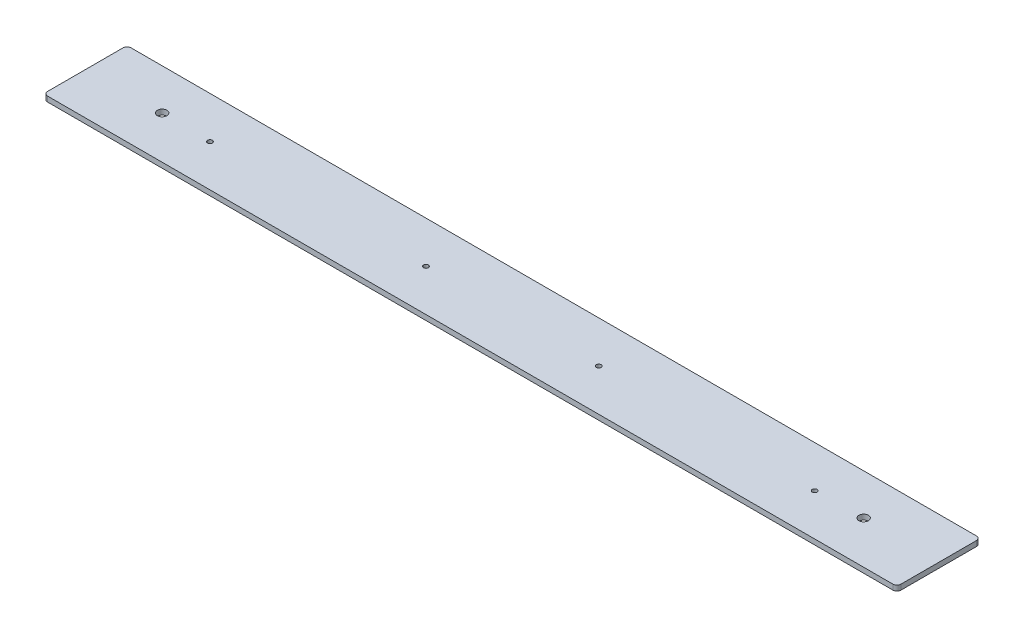
ISO-10303-21;
HEADER;
FILE_DESCRIPTION(('STEP AP214'),'2;1');
FILE_NAME('part.step','',(''),(''),'','','');
FILE_SCHEMA(('AUTOMOTIVE_DESIGN { 1 0 10303 214 1 1 1 1 }'));
ENDSEC;
DATA;
#1=APPLICATION_CONTEXT('core data for automotive mechanical design processes');
#2=APPLICATION_PROTOCOL_DEFINITION('international standard','automotive_design',2000,#1);
#3=PRODUCT_CONTEXT('',#1,'mechanical');
#4=PRODUCT('Part','Part','',(#3));
#5=PRODUCT_RELATED_PRODUCT_CATEGORY('part','',(#4));
#6=PRODUCT_DEFINITION_FORMATION('','',#4);
#7=PRODUCT_DEFINITION_CONTEXT('part definition',#1,'design');
#8=PRODUCT_DEFINITION('design','',#6,#7);
#9=PRODUCT_DEFINITION_SHAPE('','',#8);
#10=(LENGTH_UNIT() NAMED_UNIT(*) SI_UNIT(.MILLI.,.METRE.));
#11=(NAMED_UNIT(*) PLANE_ANGLE_UNIT() SI_UNIT($,.RADIAN.));
#12=(NAMED_UNIT(*) SI_UNIT($,.STERADIAN.) SOLID_ANGLE_UNIT());
#13=UNCERTAINTY_MEASURE_WITH_UNIT(LENGTH_MEASURE(1.E-05),#10,'distance_accuracy_value','');
#14=(GEOMETRIC_REPRESENTATION_CONTEXT(3) GLOBAL_UNCERTAINTY_ASSIGNED_CONTEXT((#13)) GLOBAL_UNIT_ASSIGNED_CONTEXT((#10,
#11,#12)) REPRESENTATION_CONTEXT('',''));
#15=CARTESIAN_POINT('',(0.,0.,0.));
#16=DIRECTION('',(0.,0.,1.));
#17=DIRECTION('',(1.,0.,0.));
#18=AXIS2_PLACEMENT_3D('',#15,#16,#17);
#19=CARTESIAN_POINT('',(0.,3.175,0.));
#20=DIRECTION('',(0.,-1.,0.));
#21=DIRECTION('',(0.,0.,-1.));
#22=AXIS2_PLACEMENT_3D('',#19,#20,#21);
#23=PLANE('',#22);
#24=CARTESIAN_POINT('',(213.36,3.175,-0.544410899999966));
#25=DIRECTION('',(0.,-1.,0.));
#26=DIRECTION('',(0.,0.,-1.));
#27=AXIS2_PLACEMENT_3D('',#24,#25,#26);
#28=CIRCLE('',#27,2.8956);
#29=CARTESIAN_POINT('',(213.36,3.175,-3.44001089999996));
#30=VERTEX_POINT('',#29);
#31=EDGE_CURVE('E200',#30,#30,#28,.T.);
#32=ORIENTED_EDGE('',*,*,#31,.T.);
#33=EDGE_LOOP('',(#32));
#34=FACE_BOUND('',#33,.T.);
#35=CARTESIAN_POINT('',(-213.36,3.175,-0.544410899999966));
#36=DIRECTION('',(0.,-1.,0.));
#37=DIRECTION('',(0.,0.,-1.));
#38=AXIS2_PLACEMENT_3D('',#35,#36,#37);
#39=CIRCLE('',#38,2.8956);
#40=CARTESIAN_POINT('',(-213.36,3.175,-3.44001089999996));
#41=VERTEX_POINT('',#40);
#42=EDGE_CURVE('E194',#41,#41,#39,.T.);
#43=ORIENTED_EDGE('',*,*,#42,.T.);
#44=EDGE_LOOP('',(#43));
#45=FACE_BOUND('',#44,.T.);
#46=CARTESIAN_POINT('',(184.1103125,3.175,0.));
#47=DIRECTION('',(0.,1.,0.));
#48=DIRECTION('',(0.,0.,1.));
#49=AXIS2_PLACEMENT_3D('',#46,#47,#48);
#50=CIRCLE('',#49,1.47319999999998);
#51=CARTESIAN_POINT('',(184.1103125,3.175,1.47319999999997));
#52=VERTEX_POINT('',#51);
#53=EDGE_CURVE('E191',#52,#52,#50,.T.);
#54=ORIENTED_EDGE('',*,*,#53,.F.);
#55=EDGE_LOOP('',(#54));
#56=FACE_BOUND('',#55,.T.);
#57=CARTESIAN_POINT('',(52.7446874999999,3.175,0.));
#58=DIRECTION('',(0.,1.,0.));
#59=DIRECTION('',(0.,0.,1.));
#60=AXIS2_PLACEMENT_3D('',#57,#58,#59);
#61=CIRCLE('',#60,1.47319999999999);
#62=CARTESIAN_POINT('',(52.7446874999999,3.175,1.47319999999997));
#63=VERTEX_POINT('',#62);
#64=EDGE_CURVE('E185',#63,#63,#61,.T.);
#65=ORIENTED_EDGE('',*,*,#64,.F.);
#66=EDGE_LOOP('',(#65));
#67=FACE_BOUND('',#66,.T.);
#68=CARTESIAN_POINT('',(-183.7134375,3.175,0.));
#69=DIRECTION('',(0.,1.,0.));
#70=DIRECTION('',(0.,0.,1.));
#71=AXIS2_PLACEMENT_3D('',#68,#69,#70);
#72=CIRCLE('',#71,1.47319999999998);
#73=CARTESIAN_POINT('',(-183.7134375,3.175,1.47319999999997));
#74=VERTEX_POINT('',#73);
#75=EDGE_CURVE('E165',#74,#74,#72,.T.);
#76=ORIENTED_EDGE('',*,*,#75,.F.);
#77=EDGE_LOOP('',(#76));
#78=FACE_BOUND('',#77,.T.);
#79=DIRECTION('',(-1.,0.,0.));
#80=VECTOR('',#79,1.);
#81=CARTESIAN_POINT('',(-259.55625,3.175,-25.4));
#82=LINE('',#81,#80);
#83=CARTESIAN_POINT('',(257.01625,3.175,-25.4));
#84=VERTEX_POINT('',#83);
#85=CARTESIAN_POINT('',(-257.01625,3.175,-25.4));
#86=VERTEX_POINT('',#85);
#87=EDGE_CURVE('E170',#84,#86,#82,.T.);
#88=ORIENTED_EDGE('',*,*,#87,.T.);
#89=CARTESIAN_POINT('',(-257.01625,3.175,-22.86));
#90=DIRECTION('',(0.,-1.,0.));
#91=DIRECTION('',(0.,0.,-1.));
#92=AXIS2_PLACEMENT_3D('',#89,#90,#91);
#93=CIRCLE('',#92,2.54);
#94=CARTESIAN_POINT('',(-259.55625,3.175,-22.86));
#95=VERTEX_POINT('',#94);
#96=EDGE_CURVE('E147',#86,#95,#93,.F.);
#97=ORIENTED_EDGE('',*,*,#96,.T.);
#98=DIRECTION('',(0.,0.,1.));
#99=VECTOR('',#98,1.);
#100=CARTESIAN_POINT('',(-259.55625,3.175,25.4));
#101=LINE('',#100,#99);
#102=CARTESIAN_POINT('',(-259.55625,3.175,22.86));
#103=VERTEX_POINT('',#102);
#104=EDGE_CURVE('E118',#95,#103,#101,.T.);
#105=ORIENTED_EDGE('',*,*,#104,.T.);
#106=CARTESIAN_POINT('',(-257.01625,3.175,22.86));
#107=DIRECTION('',(0.,-1.,0.));
#108=DIRECTION('',(0.,0.,-1.));
#109=AXIS2_PLACEMENT_3D('',#106,#107,#108);
#110=CIRCLE('',#109,2.54);
#111=CARTESIAN_POINT('',(-257.01625,3.175,25.4));
#112=VERTEX_POINT('',#111);
#113=EDGE_CURVE('E55',#103,#112,#110,.F.);
#114=ORIENTED_EDGE('',*,*,#113,.T.);
#115=DIRECTION('',(1.,0.,0.));
#116=VECTOR('',#115,1.);
#117=CARTESIAN_POINT('',(-259.55625,3.175,25.4));
#118=LINE('',#117,#116);
#119=CARTESIAN_POINT('',(257.01625,3.175,25.4));
#120=VERTEX_POINT('',#119);
#121=EDGE_CURVE('E133',#112,#120,#118,.T.);
#122=ORIENTED_EDGE('',*,*,#121,.T.);
#123=CARTESIAN_POINT('',(257.01625,3.175,22.86));
#124=DIRECTION('',(0.,-1.,0.));
#125=DIRECTION('',(0.,0.,-1.));
#126=AXIS2_PLACEMENT_3D('',#123,#124,#125);
#127=CIRCLE('',#126,2.54);
#128=CARTESIAN_POINT('',(259.55625,3.175,22.86));
#129=VERTEX_POINT('',#128);
#130=EDGE_CURVE('E142',#120,#129,#127,.F.);
#131=ORIENTED_EDGE('',*,*,#130,.T.);
#132=DIRECTION('',(0.,0.,-1.));
#133=VECTOR('',#132,1.);
#134=CARTESIAN_POINT('',(259.55625,3.175,25.4));
#135=LINE('',#134,#133);
#136=CARTESIAN_POINT('',(259.55625,3.175,-22.86));
#137=VERTEX_POINT('',#136);
#138=EDGE_CURVE('E127',#129,#137,#135,.T.);
#139=ORIENTED_EDGE('',*,*,#138,.T.);
#140=CARTESIAN_POINT('',(257.01625,3.175,-22.86));
#141=DIRECTION('',(0.,-1.,0.));
#142=DIRECTION('',(0.,0.,-1.));
#143=AXIS2_PLACEMENT_3D('',#140,#141,#142);
#144=CIRCLE('',#143,2.54);
#145=EDGE_CURVE('E144',#137,#84,#144,.F.);
#146=ORIENTED_EDGE('',*,*,#145,.T.);
#147=EDGE_LOOP('',(#88,#97,#105,#114,#122,#131,#139,#146));
#148=FACE_BOUND('',#147,.T.);
#149=CARTESIAN_POINT('',(-52.3478125000001,3.175,0.));
#150=DIRECTION('',(0.,1.,0.));
#151=DIRECTION('',(0.,0.,1.));
#152=AXIS2_PLACEMENT_3D('',#149,#150,#151);
#153=CIRCLE('',#152,1.47319999999999);
#154=CARTESIAN_POINT('',(-52.3478125000001,3.175,1.47319999999997));
#155=VERTEX_POINT('',#154);
#156=EDGE_CURVE('E179',#155,#155,#153,.T.);
#157=ORIENTED_EDGE('',*,*,#156,.F.);
#158=EDGE_LOOP('',(#157));
#159=FACE_BOUND('',#158,.T.);
#160=ADVANCED_FACE('F33',(#34,#45,#56,#67,#78,#148,#159),#23,.F.);
#161=CARTESIAN_POINT('',(259.55625,3.175,25.4));
#162=DIRECTION('',(-1.,0.,0.));
#163=DIRECTION('',(0.,0.,1.));
#164=AXIS2_PLACEMENT_3D('',#161,#162,#163);
#165=PLANE('',#164);
#166=DIRECTION('',(0.,0.,-1.));
#167=VECTOR('',#166,1.);
#168=CARTESIAN_POINT('',(259.55625,0.,25.4));
#169=LINE('',#168,#167);
#170=CARTESIAN_POINT('',(259.55625,0.,22.86));
#171=VERTEX_POINT('',#170);
#172=CARTESIAN_POINT('',(259.55625,0.,-22.86));
#173=VERTEX_POINT('',#172);
#174=EDGE_CURVE('E129',#171,#173,#169,.T.);
#175=ORIENTED_EDGE('',*,*,#174,.T.);
#176=DIRECTION('',(0.,-1.,0.));
#177=VECTOR('',#176,1.);
#178=CARTESIAN_POINT('',(259.55625,3.175,-22.86));
#179=LINE('',#178,#177);
#180=EDGE_CURVE('E11',#173,#137,#179,.F.);
#181=ORIENTED_EDGE('',*,*,#180,.T.);
#182=ORIENTED_EDGE('',*,*,#138,.F.);
#183=DIRECTION('',(0.,-1.,0.));
#184=VECTOR('',#183,1.);
#185=CARTESIAN_POINT('',(259.55625,3.175,22.86));
#186=LINE('',#185,#184);
#187=EDGE_CURVE('E41',#129,#171,#186,.T.);
#188=ORIENTED_EDGE('',*,*,#187,.T.);
#189=EDGE_LOOP('',(#175,#181,#182,#188));
#190=FACE_BOUND('',#189,.T.);
#191=ADVANCED_FACE('F158',(#190),#165,.F.);
#192=CARTESIAN_POINT('',(-259.55625,3.175,-25.4));
#193=DIRECTION('',(0.,0.,1.));
#194=DIRECTION('',(1.,0.,0.));
#195=AXIS2_PLACEMENT_3D('',#192,#193,#194);
#196=PLANE('',#195);
#197=DIRECTION('',(-1.,0.,0.));
#198=VECTOR('',#197,1.);
#199=CARTESIAN_POINT('',(-259.55625,0.,-25.4));
#200=LINE('',#199,#198);
#201=CARTESIAN_POINT('',(257.01625,0.,-25.4));
#202=VERTEX_POINT('',#201);
#203=CARTESIAN_POINT('',(-257.01625,0.,-25.4));
#204=VERTEX_POINT('',#203);
#205=EDGE_CURVE('E125',#202,#204,#200,.T.);
#206=ORIENTED_EDGE('',*,*,#205,.T.);
#207=DIRECTION('',(0.,-1.,0.));
#208=VECTOR('',#207,1.);
#209=CARTESIAN_POINT('',(-257.01625,3.175,-25.4));
#210=LINE('',#209,#208);
#211=EDGE_CURVE('E104',#204,#86,#210,.F.);
#212=ORIENTED_EDGE('',*,*,#211,.T.);
#213=ORIENTED_EDGE('',*,*,#87,.F.);
#214=DIRECTION('',(0.,-1.,0.));
#215=VECTOR('',#214,1.);
#216=CARTESIAN_POINT('',(257.01625,3.175,-25.4));
#217=LINE('',#216,#215);
#218=EDGE_CURVE('E109',#84,#202,#217,.T.);
#219=ORIENTED_EDGE('',*,*,#218,.T.);
#220=EDGE_LOOP('',(#206,#212,#213,#219));
#221=FACE_BOUND('',#220,.T.);
#222=ADVANCED_FACE('F253',(#221),#196,.F.);
#223=CARTESIAN_POINT('',(-259.55625,3.175,25.4));
#224=DIRECTION('',(1.,0.,0.));
#225=DIRECTION('',(0.,0.,-1.));
#226=AXIS2_PLACEMENT_3D('',#223,#224,#225);
#227=PLANE('',#226);
#228=ORIENTED_EDGE('',*,*,#104,.F.);
#229=DIRECTION('',(0.,-1.,0.));
#230=VECTOR('',#229,1.);
#231=CARTESIAN_POINT('',(-259.55625,3.175,-22.86));
#232=LINE('',#231,#230);
#233=CARTESIAN_POINT('',(-259.55625,0.,-22.86));
#234=VERTEX_POINT('',#233);
#235=EDGE_CURVE('E103',#95,#234,#232,.T.);
#236=ORIENTED_EDGE('',*,*,#235,.T.);
#237=DIRECTION('',(0.,0.,1.));
#238=VECTOR('',#237,1.);
#239=CARTESIAN_POINT('',(-259.55625,0.,25.4));
#240=LINE('',#239,#238);
#241=CARTESIAN_POINT('',(-259.55625,0.,22.86));
#242=VERTEX_POINT('',#241);
#243=EDGE_CURVE('E116',#234,#242,#240,.T.);
#244=ORIENTED_EDGE('',*,*,#243,.T.);
#245=DIRECTION('',(0.,-1.,0.));
#246=VECTOR('',#245,1.);
#247=CARTESIAN_POINT('',(-259.55625,3.175,22.86));
#248=LINE('',#247,#246);
#249=EDGE_CURVE('E120',#242,#103,#248,.F.);
#250=ORIENTED_EDGE('',*,*,#249,.T.);
#251=EDGE_LOOP('',(#228,#236,#244,#250));
#252=FACE_BOUND('',#251,.T.);
#253=ADVANCED_FACE('F115',(#252),#227,.F.);
#254=CARTESIAN_POINT('',(-259.55625,3.175,25.4));
#255=DIRECTION('',(0.,0.,-1.));
#256=DIRECTION('',(-1.,0.,0.));
#257=AXIS2_PLACEMENT_3D('',#254,#255,#256);
#258=PLANE('',#257);
#259=ORIENTED_EDGE('',*,*,#121,.F.);
#260=DIRECTION('',(0.,-1.,0.));
#261=VECTOR('',#260,1.);
#262=CARTESIAN_POINT('',(-257.01625,3.175,25.4));
#263=LINE('',#262,#261);
#264=CARTESIAN_POINT('',(-257.01625,0.,25.4));
#265=VERTEX_POINT('',#264);
#266=EDGE_CURVE('E150',#112,#265,#263,.T.);
#267=ORIENTED_EDGE('',*,*,#266,.T.);
#268=DIRECTION('',(1.,0.,0.));
#269=VECTOR('',#268,1.);
#270=CARTESIAN_POINT('',(-259.55625,0.,25.4));
#271=LINE('',#270,#269);
#272=CARTESIAN_POINT('',(257.01625,0.,25.4));
#273=VERTEX_POINT('',#272);
#274=EDGE_CURVE('E124',#265,#273,#271,.T.);
#275=ORIENTED_EDGE('',*,*,#274,.T.);
#276=DIRECTION('',(0.,-1.,0.));
#277=VECTOR('',#276,1.);
#278=CARTESIAN_POINT('',(257.01625,3.175,25.4));
#279=LINE('',#278,#277);
#280=EDGE_CURVE('E48',#273,#120,#279,.F.);
#281=ORIENTED_EDGE('',*,*,#280,.T.);
#282=EDGE_LOOP('',(#259,#267,#275,#281));
#283=FACE_BOUND('',#282,.T.);
#284=ADVANCED_FACE('F211',(#283),#258,.F.);
#285=CARTESIAN_POINT('',(0.,0.,0.));
#286=DIRECTION('',(0.,-1.,0.));
#287=DIRECTION('',(0.,0.,-1.));
#288=AXIS2_PLACEMENT_3D('',#285,#286,#287);
#289=PLANE('',#288);
#290=CARTESIAN_POINT('',(213.36,0.,-0.544410899999966));
#291=DIRECTION('',(0.,-1.,0.));
#292=DIRECTION('',(0.,0.,-1.));
#293=AXIS2_PLACEMENT_3D('',#290,#291,#292);
#294=CIRCLE('',#293,2.8956);
#295=CARTESIAN_POINT('',(213.36,0.,-3.44001089999996));
#296=VERTEX_POINT('',#295);
#297=EDGE_CURVE('E203',#296,#296,#294,.T.);
#298=ORIENTED_EDGE('',*,*,#297,.F.);
#299=EDGE_LOOP('',(#298));
#300=FACE_BOUND('',#299,.T.);
#301=CARTESIAN_POINT('',(-213.36,0.,-0.544410899999966));
#302=DIRECTION('',(0.,-1.,0.));
#303=DIRECTION('',(0.,0.,-1.));
#304=AXIS2_PLACEMENT_3D('',#301,#302,#303);
#305=CIRCLE('',#304,2.8956);
#306=CARTESIAN_POINT('',(-213.36,0.,-3.44001089999996));
#307=VERTEX_POINT('',#306);
#308=EDGE_CURVE('E197',#307,#307,#305,.T.);
#309=ORIENTED_EDGE('',*,*,#308,.F.);
#310=EDGE_LOOP('',(#309));
#311=FACE_BOUND('',#310,.T.);
#312=CARTESIAN_POINT('',(184.1103125,0.,0.));
#313=DIRECTION('',(0.,1.,0.));
#314=DIRECTION('',(0.,0.,1.));
#315=AXIS2_PLACEMENT_3D('',#312,#313,#314);
#316=CIRCLE('',#315,1.47320000000001);
#317=CARTESIAN_POINT('',(184.1103125,0.,1.47319999999999));
#318=VERTEX_POINT('',#317);
#319=EDGE_CURVE('E188',#318,#318,#316,.T.);
#320=ORIENTED_EDGE('',*,*,#319,.T.);
#321=EDGE_LOOP('',(#320));
#322=FACE_BOUND('',#321,.T.);
#323=CARTESIAN_POINT('',(52.7446874999999,0.,0.));
#324=DIRECTION('',(0.,1.,0.));
#325=DIRECTION('',(0.,0.,1.));
#326=AXIS2_PLACEMENT_3D('',#323,#324,#325);
#327=CIRCLE('',#326,1.4732);
#328=CARTESIAN_POINT('',(52.7446874999999,0.,1.47319999999999));
#329=VERTEX_POINT('',#328);
#330=EDGE_CURVE('E182',#329,#329,#327,.T.);
#331=ORIENTED_EDGE('',*,*,#330,.T.);
#332=EDGE_LOOP('',(#331));
#333=FACE_BOUND('',#332,.T.);
#334=CARTESIAN_POINT('',(-52.3478125000001,0.,0.));
#335=DIRECTION('',(0.,1.,0.));
#336=DIRECTION('',(0.,0.,1.));
#337=AXIS2_PLACEMENT_3D('',#334,#335,#336);
#338=CIRCLE('',#337,1.4732);
#339=CARTESIAN_POINT('',(-52.3478125000001,0.,1.47319999999998));
#340=VERTEX_POINT('',#339);
#341=EDGE_CURVE('E176',#340,#340,#338,.T.);
#342=ORIENTED_EDGE('',*,*,#341,.T.);
#343=EDGE_LOOP('',(#342));
#344=FACE_BOUND('',#343,.T.);
#345=CARTESIAN_POINT('',(-183.7134375,0.,0.));
#346=DIRECTION('',(0.,1.,0.));
#347=DIRECTION('',(0.,0.,1.));
#348=AXIS2_PLACEMENT_3D('',#345,#346,#347);
#349=CIRCLE('',#348,1.47320000000001);
#350=CARTESIAN_POINT('',(-183.7134375,0.,1.47319999999999));
#351=VERTEX_POINT('',#350);
#352=EDGE_CURVE('E163',#351,#351,#349,.T.);
#353=ORIENTED_EDGE('',*,*,#352,.T.);
#354=EDGE_LOOP('',(#353));
#355=FACE_BOUND('',#354,.T.);
#356=ORIENTED_EDGE('',*,*,#243,.F.);
#357=CARTESIAN_POINT('',(-257.01625,0.,-22.86));
#358=DIRECTION('',(0.,-1.,0.));
#359=DIRECTION('',(0.,0.,-1.));
#360=AXIS2_PLACEMENT_3D('',#357,#358,#359);
#361=CIRCLE('',#360,2.54);
#362=EDGE_CURVE('E99',#234,#204,#361,.T.);
#363=ORIENTED_EDGE('',*,*,#362,.T.);
#364=ORIENTED_EDGE('',*,*,#205,.F.);
#365=CARTESIAN_POINT('',(257.01625,0.,-22.86));
#366=DIRECTION('',(0.,-1.,0.));
#367=DIRECTION('',(0.,0.,-1.));
#368=AXIS2_PLACEMENT_3D('',#365,#366,#367);
#369=CIRCLE('',#368,2.54);
#370=EDGE_CURVE('E136',#202,#173,#369,.T.);
#371=ORIENTED_EDGE('',*,*,#370,.T.);
#372=ORIENTED_EDGE('',*,*,#174,.F.);
#373=CARTESIAN_POINT('',(257.01625,0.,22.86));
#374=DIRECTION('',(0.,-1.,0.));
#375=DIRECTION('',(0.,0.,-1.));
#376=AXIS2_PLACEMENT_3D('',#373,#374,#375);
#377=CIRCLE('',#376,2.54);
#378=EDGE_CURVE('E119',#171,#273,#377,.T.);
#379=ORIENTED_EDGE('',*,*,#378,.T.);
#380=ORIENTED_EDGE('',*,*,#274,.F.);
#381=CARTESIAN_POINT('',(-257.01625,0.,22.86));
#382=DIRECTION('',(0.,-1.,0.));
#383=DIRECTION('',(0.,0.,-1.));
#384=AXIS2_PLACEMENT_3D('',#381,#382,#383);
#385=CIRCLE('',#384,2.54);
#386=EDGE_CURVE('E110',#265,#242,#385,.T.);
#387=ORIENTED_EDGE('',*,*,#386,.T.);
#388=EDGE_LOOP('',(#356,#363,#364,#371,#372,#379,#380,#387));
#389=FACE_BOUND('',#388,.T.);
#390=ADVANCED_FACE('F122',(#300,#311,#322,#333,#344,#355,#389),#289,.T.);
#391=CARTESIAN_POINT('',(-257.01625,3.175,-22.86));
#392=DIRECTION('',(0.,-1.,0.));
#393=DIRECTION('',(0.,0.,-1.));
#394=AXIS2_PLACEMENT_3D('',#391,#392,#393);
#395=CYLINDRICAL_SURFACE('',#394,2.54);
#396=ORIENTED_EDGE('',*,*,#96,.F.);
#397=ORIENTED_EDGE('',*,*,#211,.F.);
#398=ORIENTED_EDGE('',*,*,#362,.F.);
#399=ORIENTED_EDGE('',*,*,#235,.F.);
#400=EDGE_LOOP('',(#396,#397,#398,#399));
#401=FACE_BOUND('',#400,.T.);
#402=ADVANCED_FACE('F102',(#401),#395,.T.);
#403=CARTESIAN_POINT('',(-257.01625,3.175,22.86));
#404=DIRECTION('',(0.,-1.,0.));
#405=DIRECTION('',(0.,0.,-1.));
#406=AXIS2_PLACEMENT_3D('',#403,#404,#405);
#407=CYLINDRICAL_SURFACE('',#406,2.54);
#408=ORIENTED_EDGE('',*,*,#113,.F.);
#409=ORIENTED_EDGE('',*,*,#249,.F.);
#410=ORIENTED_EDGE('',*,*,#386,.F.);
#411=ORIENTED_EDGE('',*,*,#266,.F.);
#412=EDGE_LOOP('',(#408,#409,#410,#411));
#413=FACE_BOUND('',#412,.T.);
#414=ADVANCED_FACE('F261',(#413),#407,.T.);
#415=CARTESIAN_POINT('',(257.01625,3.175,-22.86));
#416=DIRECTION('',(0.,-1.,0.));
#417=DIRECTION('',(0.,0.,-1.));
#418=AXIS2_PLACEMENT_3D('',#415,#416,#417);
#419=CYLINDRICAL_SURFACE('',#418,2.54);
#420=ORIENTED_EDGE('',*,*,#145,.F.);
#421=ORIENTED_EDGE('',*,*,#180,.F.);
#422=ORIENTED_EDGE('',*,*,#370,.F.);
#423=ORIENTED_EDGE('',*,*,#218,.F.);
#424=EDGE_LOOP('',(#420,#421,#422,#423));
#425=FACE_BOUND('',#424,.T.);
#426=ADVANCED_FACE('F263',(#425),#419,.T.);
#427=CARTESIAN_POINT('',(257.01625,3.175,22.86));
#428=DIRECTION('',(0.,-1.,0.));
#429=DIRECTION('',(0.,0.,-1.));
#430=AXIS2_PLACEMENT_3D('',#427,#428,#429);
#431=CYLINDRICAL_SURFACE('',#430,2.54);
#432=ORIENTED_EDGE('',*,*,#130,.F.);
#433=ORIENTED_EDGE('',*,*,#280,.F.);
#434=ORIENTED_EDGE('',*,*,#378,.F.);
#435=ORIENTED_EDGE('',*,*,#187,.F.);
#436=EDGE_LOOP('',(#432,#433,#434,#435));
#437=FACE_BOUND('',#436,.T.);
#438=ADVANCED_FACE('F35',(#437),#431,.T.);
#439=CARTESIAN_POINT('',(-183.7134375,3.175,0.));
#440=DIRECTION('',(0.,1.,0.));
#441=DIRECTION('',(0.,0.,1.));
#442=AXIS2_PLACEMENT_3D('',#439,#440,#441);
#443=CYLINDRICAL_SURFACE('',#442,1.47319999999999);
#444=ORIENTED_EDGE('',*,*,#352,.F.);
#445=EDGE_LOOP('',(#444));
#446=FACE_BOUND('',#445,.T.);
#447=ORIENTED_EDGE('',*,*,#75,.T.);
#448=EDGE_LOOP('',(#447));
#449=FACE_BOUND('',#448,.T.);
#450=ADVANCED_FACE('F223',(#446,#449),#443,.F.);
#451=CARTESIAN_POINT('',(-52.3478125000001,3.175,0.));
#452=DIRECTION('',(0.,1.,0.));
#453=DIRECTION('',(0.,0.,1.));
#454=AXIS2_PLACEMENT_3D('',#451,#452,#453);
#455=CYLINDRICAL_SURFACE('',#454,1.47319999999999);
#456=ORIENTED_EDGE('',*,*,#341,.F.);
#457=EDGE_LOOP('',(#456));
#458=FACE_BOUND('',#457,.T.);
#459=ORIENTED_EDGE('',*,*,#156,.T.);
#460=EDGE_LOOP('',(#459));
#461=FACE_BOUND('',#460,.T.);
#462=ADVANCED_FACE('F226',(#458,#461),#455,.F.);
#463=CARTESIAN_POINT('',(52.7446874999999,3.175,0.));
#464=DIRECTION('',(0.,1.,0.));
#465=DIRECTION('',(0.,0.,1.));
#466=AXIS2_PLACEMENT_3D('',#463,#464,#465);
#467=CYLINDRICAL_SURFACE('',#466,1.47319999999999);
#468=ORIENTED_EDGE('',*,*,#330,.F.);
#469=EDGE_LOOP('',(#468));
#470=FACE_BOUND('',#469,.T.);
#471=ORIENTED_EDGE('',*,*,#64,.T.);
#472=EDGE_LOOP('',(#471));
#473=FACE_BOUND('',#472,.T.);
#474=ADVANCED_FACE('F238',(#470,#473),#467,.F.);
#475=CARTESIAN_POINT('',(184.1103125,3.175,0.));
#476=DIRECTION('',(0.,1.,0.));
#477=DIRECTION('',(0.,0.,1.));
#478=AXIS2_PLACEMENT_3D('',#475,#476,#477);
#479=CYLINDRICAL_SURFACE('',#478,1.47319999999999);
#480=ORIENTED_EDGE('',*,*,#319,.F.);
#481=EDGE_LOOP('',(#480));
#482=FACE_BOUND('',#481,.T.);
#483=ORIENTED_EDGE('',*,*,#53,.T.);
#484=EDGE_LOOP('',(#483));
#485=FACE_BOUND('',#484,.T.);
#486=ADVANCED_FACE('F244',(#482,#485),#479,.F.);
#487=CARTESIAN_POINT('',(-213.36,0.,-0.544410899999966));
#488=DIRECTION('',(0.,-1.,0.));
#489=DIRECTION('',(0.,0.,-1.));
#490=AXIS2_PLACEMENT_3D('',#487,#488,#489);
#491=CYLINDRICAL_SURFACE('',#490,2.8956);
#492=ORIENTED_EDGE('',*,*,#42,.F.);
#493=EDGE_LOOP('',(#492));
#494=FACE_BOUND('',#493,.T.);
#495=ORIENTED_EDGE('',*,*,#308,.T.);
#496=EDGE_LOOP('',(#495));
#497=FACE_BOUND('',#496,.T.);
#498=ADVANCED_FACE('F302',(#494,#497),#491,.F.);
#499=CARTESIAN_POINT('',(213.36,0.,-0.544410899999966));
#500=DIRECTION('',(0.,-1.,0.));
#501=DIRECTION('',(0.,0.,-1.));
#502=AXIS2_PLACEMENT_3D('',#499,#500,#501);
#503=CYLINDRICAL_SURFACE('',#502,2.8956);
#504=ORIENTED_EDGE('',*,*,#31,.F.);
#505=EDGE_LOOP('',(#504));
#506=FACE_BOUND('',#505,.T.);
#507=ORIENTED_EDGE('',*,*,#297,.T.);
#508=EDGE_LOOP('',(#507));
#509=FACE_BOUND('',#508,.T.);
#510=ADVANCED_FACE('F207',(#506,#509),#503,.F.);
#511=CLOSED_SHELL('',(#160,#191,#222,#253,#284,#390,#402,#414,#426,#438,#450,#462,#474,#486,
#498,#510));
#512=MANIFOLD_SOLID_BREP('B2',#511);
#513=ADVANCED_BREP_SHAPE_REPRESENTATION('',(#18,#512),#14);
#514=SHAPE_DEFINITION_REPRESENTATION(#9,#513);
ENDSEC;
END-ISO-10303-21;
